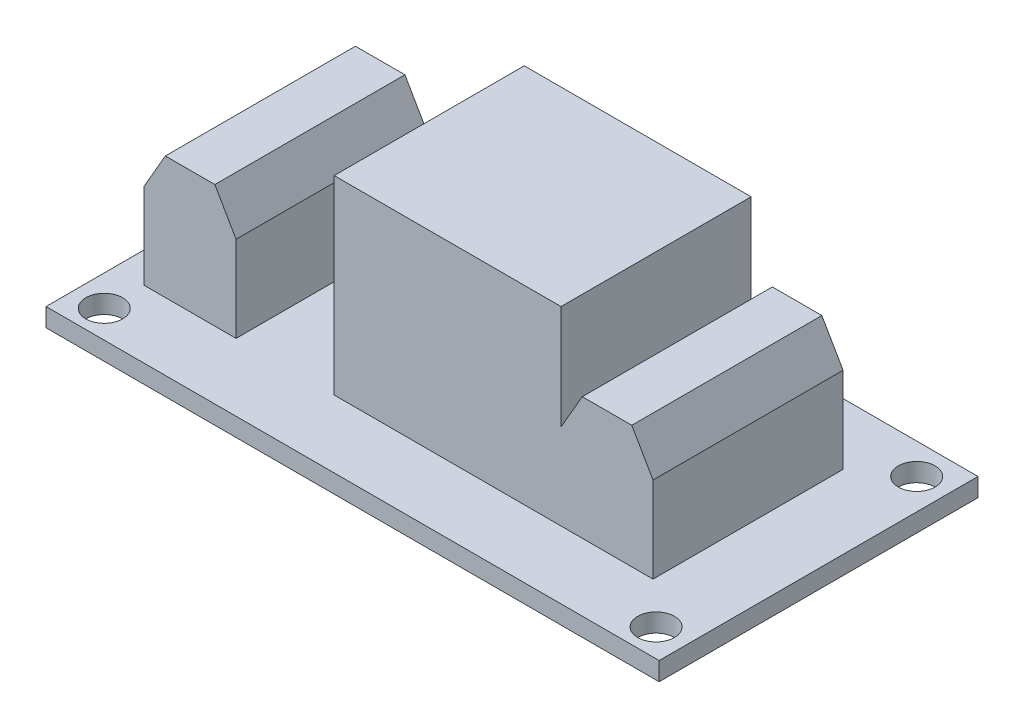
ISO-10303-21;
HEADER;
FILE_DESCRIPTION(('STEP AP214'),'2;1');
FILE_NAME('part.step','',(''),(''),'','','');
FILE_SCHEMA(('AUTOMOTIVE_DESIGN { 1 0 10303 214 1 1 1 1 }'));
ENDSEC;
DATA;
#1=APPLICATION_CONTEXT('core data for automotive mechanical design processes');
#2=APPLICATION_PROTOCOL_DEFINITION('international standard','automotive_design',2000,#1);
#3=PRODUCT_CONTEXT('',#1,'mechanical');
#4=PRODUCT('Part','Part','',(#3));
#5=PRODUCT_RELATED_PRODUCT_CATEGORY('part','',(#4));
#6=PRODUCT_DEFINITION_FORMATION('','',#4);
#7=PRODUCT_DEFINITION_CONTEXT('part definition',#1,'design');
#8=PRODUCT_DEFINITION('design','',#6,#7);
#9=PRODUCT_DEFINITION_SHAPE('','',#8);
#10=(LENGTH_UNIT() NAMED_UNIT(*) SI_UNIT(.MILLI.,.METRE.));
#11=(NAMED_UNIT(*) PLANE_ANGLE_UNIT() SI_UNIT($,.RADIAN.));
#12=(NAMED_UNIT(*) SI_UNIT($,.STERADIAN.) SOLID_ANGLE_UNIT());
#13=UNCERTAINTY_MEASURE_WITH_UNIT(LENGTH_MEASURE(1.E-05),#10,'distance_accuracy_value','');
#14=(GEOMETRIC_REPRESENTATION_CONTEXT(3) GLOBAL_UNCERTAINTY_ASSIGNED_CONTEXT((#13)) GLOBAL_UNIT_ASSIGNED_CONTEXT((#10,
#11,#12)) REPRESENTATION_CONTEXT('',''));
#15=CARTESIAN_POINT('',(0.,0.,0.));
#16=DIRECTION('',(0.,0.,1.));
#17=DIRECTION('',(1.,0.,0.));
#18=AXIS2_PLACEMENT_3D('',#15,#16,#17);
#19=CARTESIAN_POINT('',(0.,1.5,0.));
#20=DIRECTION('',(0.,-1.,0.));
#21=DIRECTION('',(0.,0.,-1.));
#22=AXIS2_PLACEMENT_3D('',#19,#20,#21);
#23=PLANE('',#22);
#24=CARTESIAN_POINT('',(-22.5,1.5,-10.5));
#25=DIRECTION('',(0.,-1.,0.));
#26=DIRECTION('',(0.,0.,-1.));
#27=AXIS2_PLACEMENT_3D('',#24,#25,#26);
#28=CIRCLE('',#27,1.5);
#29=CARTESIAN_POINT('',(-22.5,1.5,-12.));
#30=VERTEX_POINT('',#29);
#31=EDGE_CURVE('E744',#30,#30,#28,.T.);
#32=ORIENTED_EDGE('',*,*,#31,.T.);
#33=EDGE_LOOP('',(#32));
#34=FACE_BOUND('',#33,.T.);
#35=CARTESIAN_POINT('',(22.5,1.5,-10.5));
#36=DIRECTION('',(0.,-1.,0.));
#37=DIRECTION('',(0.,0.,-1.));
#38=AXIS2_PLACEMENT_3D('',#35,#36,#37);
#39=CIRCLE('',#38,1.5);
#40=CARTESIAN_POINT('',(22.5,1.5,-12.));
#41=VERTEX_POINT('',#40);
#42=EDGE_CURVE('E738',#41,#41,#39,.T.);
#43=ORIENTED_EDGE('',*,*,#42,.T.);
#44=EDGE_LOOP('',(#43));
#45=FACE_BOUND('',#44,.T.);
#46=CARTESIAN_POINT('',(22.5,1.5,10.75));
#47=DIRECTION('',(0.,-1.,0.));
#48=DIRECTION('',(0.,0.,-1.));
#49=AXIS2_PLACEMENT_3D('',#46,#47,#48);
#50=CIRCLE('',#49,1.5);
#51=CARTESIAN_POINT('',(22.5,1.5,9.25));
#52=VERTEX_POINT('',#51);
#53=EDGE_CURVE('E735',#52,#52,#50,.T.);
#54=ORIENTED_EDGE('',*,*,#53,.T.);
#55=EDGE_LOOP('',(#54));
#56=FACE_BOUND('',#55,.T.);
#57=CARTESIAN_POINT('',(-22.5,1.5,10.75));
#58=DIRECTION('',(0.,-1.,0.));
#59=DIRECTION('',(0.,0.,-1.));
#60=AXIS2_PLACEMENT_3D('',#57,#58,#59);
#61=CIRCLE('',#60,1.5);
#62=CARTESIAN_POINT('',(-22.5,1.5,9.25));
#63=VERTEX_POINT('',#62);
#64=EDGE_CURVE('E739',#63,#63,#61,.T.);
#65=ORIENTED_EDGE('',*,*,#64,.T.);
#66=EDGE_LOOP('',(#65));
#67=FACE_BOUND('',#66,.T.);
#68=DIRECTION('',(0.,0.,-1.));
#69=VECTOR('',#68,1.);
#70=CARTESIAN_POINT('',(-15.,1.5,7.5));
#71=LINE('',#70,#69);
#72=CARTESIAN_POINT('',(-15.,1.5,7.5));
#73=VERTEX_POINT('',#72);
#74=CARTESIAN_POINT('',(-15.,1.5,-8.));
#75=VERTEX_POINT('',#74);
#76=EDGE_CURVE('E253',#73,#75,#71,.T.);
#77=ORIENTED_EDGE('',*,*,#76,.F.);
#78=DIRECTION('',(1.,0.,0.));
#79=VECTOR('',#78,1.);
#80=CARTESIAN_POINT('',(-22.5,1.5,7.5));
#81=LINE('',#80,#79);
#82=CARTESIAN_POINT('',(-22.5,1.5,7.5));
#83=VERTEX_POINT('',#82);
#84=EDGE_CURVE('E259',#83,#73,#81,.T.);
#85=ORIENTED_EDGE('',*,*,#84,.F.);
#86=DIRECTION('',(0.,0.,1.));
#87=VECTOR('',#86,1.);
#88=CARTESIAN_POINT('',(-22.5,1.5,7.5));
#89=LINE('',#88,#87);
#90=CARTESIAN_POINT('',(-22.5,1.5,-8.));
#91=VERTEX_POINT('',#90);
#92=EDGE_CURVE('E271',#91,#83,#89,.T.);
#93=ORIENTED_EDGE('',*,*,#92,.F.);
#94=DIRECTION('',(-1.,0.,0.));
#95=VECTOR('',#94,1.);
#96=CARTESIAN_POINT('',(-22.5,1.5,-8.));
#97=LINE('',#96,#95);
#98=EDGE_CURVE('E267',#75,#91,#97,.T.);
#99=ORIENTED_EDGE('',*,*,#98,.F.);
#100=EDGE_LOOP('',(#77,#85,#93,#99));
#101=FACE_BOUND('',#100,.T.);
#102=DIRECTION('',(0.,0.,-1.));
#103=VECTOR('',#102,1.);
#104=CARTESIAN_POINT('',(25.,1.5,13.));
#105=LINE('',#104,#103);
#106=CARTESIAN_POINT('',(25.,1.5,13.));
#107=VERTEX_POINT('',#106);
#108=CARTESIAN_POINT('',(25.,1.5,-13.));
#109=VERTEX_POINT('',#108);
#110=EDGE_CURVE('E315',#107,#109,#105,.T.);
#111=ORIENTED_EDGE('',*,*,#110,.T.);
#112=DIRECTION('',(-1.,0.,0.));
#113=VECTOR('',#112,1.);
#114=CARTESIAN_POINT('',(-25.,1.5,-13.));
#115=LINE('',#114,#113);
#116=CARTESIAN_POINT('',(-25.,1.5,-13.));
#117=VERTEX_POINT('',#116);
#118=EDGE_CURVE('E319',#109,#117,#115,.T.);
#119=ORIENTED_EDGE('',*,*,#118,.T.);
#120=DIRECTION('',(0.,0.,1.));
#121=VECTOR('',#120,1.);
#122=CARTESIAN_POINT('',(-25.,1.5,13.));
#123=LINE('',#122,#121);
#124=CARTESIAN_POINT('',(-25.,1.5,13.));
#125=VERTEX_POINT('',#124);
#126=EDGE_CURVE('E323',#117,#125,#123,.T.);
#127=ORIENTED_EDGE('',*,*,#126,.T.);
#128=DIRECTION('',(1.,0.,0.));
#129=VECTOR('',#128,1.);
#130=CARTESIAN_POINT('',(-25.,1.5,13.));
#131=LINE('',#130,#129);
#132=EDGE_CURVE('E326',#125,#107,#131,.T.);
#133=ORIENTED_EDGE('',*,*,#132,.T.);
#134=EDGE_LOOP('',(#111,#119,#127,#133));
#135=FACE_BOUND('',#134,.T.);
#136=DIRECTION('',(0.,0.,1.));
#137=VECTOR('',#136,1.);
#138=CARTESIAN_POINT('',(-7.,1.5,7.5));
#139=LINE('',#138,#137);
#140=CARTESIAN_POINT('',(-7.,1.5,-8.));
#141=VERTEX_POINT('',#140);
#142=CARTESIAN_POINT('',(-7.,1.5,7.5));
#143=VERTEX_POINT('',#142);
#144=EDGE_CURVE('E214',#141,#143,#139,.T.);
#145=ORIENTED_EDGE('',*,*,#144,.F.);
#146=DIRECTION('',(-1.,0.,0.));
#147=VECTOR('',#146,1.);
#148=CARTESIAN_POINT('',(11.5,1.5,-8.));
#149=LINE('',#148,#147);
#150=CARTESIAN_POINT('',(19.,1.5,-8.));
#151=VERTEX_POINT('',#150);
#152=EDGE_CURVE('E303',#151,#141,#149,.T.);
#153=ORIENTED_EDGE('',*,*,#152,.F.);
#154=DIRECTION('',(0.,0.,-1.));
#155=VECTOR('',#154,1.);
#156=CARTESIAN_POINT('',(19.,1.5,-8.));
#157=LINE('',#156,#155);
#158=CARTESIAN_POINT('',(19.,1.5,7.5));
#159=VERTEX_POINT('',#158);
#160=EDGE_CURVE('E289',#159,#151,#157,.T.);
#161=ORIENTED_EDGE('',*,*,#160,.F.);
#162=DIRECTION('',(1.,0.,0.));
#163=VECTOR('',#162,1.);
#164=CARTESIAN_POINT('',(11.5,1.5,7.5));
#165=LINE('',#164,#163);
#166=EDGE_CURVE('E295',#143,#159,#165,.T.);
#167=ORIENTED_EDGE('',*,*,#166,.F.);
#168=EDGE_LOOP('',(#145,#153,#161,#167));
#169=FACE_BOUND('',#168,.T.);
#170=ADVANCED_FACE('F41',(#34,#45,#56,#67,#101,#135,#169),#23,.F.);
#171=CARTESIAN_POINT('',(25.,1.5,13.));
#172=DIRECTION('',(-1.,0.,0.));
#173=DIRECTION('',(0.,0.,1.));
#174=AXIS2_PLACEMENT_3D('',#171,#172,#173);
#175=PLANE('',#174);
#176=DIRECTION('',(0.,0.,-1.));
#177=VECTOR('',#176,1.);
#178=CARTESIAN_POINT('',(25.,0.,13.));
#179=LINE('',#178,#177);
#180=CARTESIAN_POINT('',(25.,0.,13.));
#181=VERTEX_POINT('',#180);
#182=CARTESIAN_POINT('',(25.,0.,-13.));
#183=VERTEX_POINT('',#182);
#184=EDGE_CURVE('E314',#181,#183,#179,.T.);
#185=ORIENTED_EDGE('',*,*,#184,.T.);
#186=DIRECTION('',(0.,-1.,0.));
#187=VECTOR('',#186,1.);
#188=CARTESIAN_POINT('',(25.,1.5,-13.));
#189=LINE('',#188,#187);
#190=EDGE_CURVE('E352',#109,#183,#189,.T.);
#191=ORIENTED_EDGE('',*,*,#190,.F.);
#192=ORIENTED_EDGE('',*,*,#110,.F.);
#193=DIRECTION('',(0.,-1.,0.));
#194=VECTOR('',#193,1.);
#195=CARTESIAN_POINT('',(25.,1.5,13.));
#196=LINE('',#195,#194);
#197=EDGE_CURVE('E329',#107,#181,#196,.T.);
#198=ORIENTED_EDGE('',*,*,#197,.T.);
#199=EDGE_LOOP('',(#185,#191,#192,#198));
#200=FACE_BOUND('',#199,.T.);
#201=ADVANCED_FACE('F445',(#200),#175,.F.);
#202=CARTESIAN_POINT('',(-25.,1.5,-13.));
#203=DIRECTION('',(0.,0.,1.));
#204=DIRECTION('',(1.,0.,0.));
#205=AXIS2_PLACEMENT_3D('',#202,#203,#204);
#206=PLANE('',#205);
#207=DIRECTION('',(-1.,0.,0.));
#208=VECTOR('',#207,1.);
#209=CARTESIAN_POINT('',(-25.,0.,-13.));
#210=LINE('',#209,#208);
#211=CARTESIAN_POINT('',(-25.,0.,-13.));
#212=VERTEX_POINT('',#211);
#213=EDGE_CURVE('E333',#183,#212,#210,.T.);
#214=ORIENTED_EDGE('',*,*,#213,.T.);
#215=DIRECTION('',(0.,-1.,0.));
#216=VECTOR('',#215,1.);
#217=CARTESIAN_POINT('',(-25.,1.5,-13.));
#218=LINE('',#217,#216);
#219=EDGE_CURVE('E348',#117,#212,#218,.T.);
#220=ORIENTED_EDGE('',*,*,#219,.F.);
#221=ORIENTED_EDGE('',*,*,#118,.F.);
#222=ORIENTED_EDGE('',*,*,#190,.T.);
#223=EDGE_LOOP('',(#214,#220,#221,#222));
#224=FACE_BOUND('',#223,.T.);
#225=ADVANCED_FACE('F451',(#224),#206,.F.);
#226=CARTESIAN_POINT('',(-25.,1.5,13.));
#227=DIRECTION('',(1.,0.,0.));
#228=DIRECTION('',(0.,0.,-1.));
#229=AXIS2_PLACEMENT_3D('',#226,#227,#228);
#230=PLANE('',#229);
#231=DIRECTION('',(0.,0.,1.));
#232=VECTOR('',#231,1.);
#233=CARTESIAN_POINT('',(-25.,0.,13.));
#234=LINE('',#233,#232);
#235=CARTESIAN_POINT('',(-25.,0.,13.));
#236=VERTEX_POINT('',#235);
#237=EDGE_CURVE('E336',#212,#236,#234,.T.);
#238=ORIENTED_EDGE('',*,*,#237,.T.);
#239=DIRECTION('',(0.,-1.,0.));
#240=VECTOR('',#239,1.);
#241=CARTESIAN_POINT('',(-25.,1.5,13.));
#242=LINE('',#241,#240);
#243=EDGE_CURVE('E344',#125,#236,#242,.T.);
#244=ORIENTED_EDGE('',*,*,#243,.F.);
#245=ORIENTED_EDGE('',*,*,#126,.F.);
#246=ORIENTED_EDGE('',*,*,#219,.T.);
#247=EDGE_LOOP('',(#238,#244,#245,#246));
#248=FACE_BOUND('',#247,.T.);
#249=ADVANCED_FACE('F467',(#248),#230,.F.);
#250=CARTESIAN_POINT('',(-25.,1.5,13.));
#251=DIRECTION('',(0.,0.,-1.));
#252=DIRECTION('',(-1.,0.,0.));
#253=AXIS2_PLACEMENT_3D('',#250,#251,#252);
#254=PLANE('',#253);
#255=DIRECTION('',(1.,0.,0.));
#256=VECTOR('',#255,1.);
#257=CARTESIAN_POINT('',(-25.,0.,13.));
#258=LINE('',#257,#256);
#259=EDGE_CURVE('E320',#236,#181,#258,.T.);
#260=ORIENTED_EDGE('',*,*,#259,.T.);
#261=ORIENTED_EDGE('',*,*,#197,.F.);
#262=ORIENTED_EDGE('',*,*,#132,.F.);
#263=ORIENTED_EDGE('',*,*,#243,.T.);
#264=EDGE_LOOP('',(#260,#261,#262,#263));
#265=FACE_BOUND('',#264,.T.);
#266=ADVANCED_FACE('F463',(#265),#254,.F.);
#267=CARTESIAN_POINT('',(0.,0.,0.));
#268=DIRECTION('',(0.,-1.,0.));
#269=DIRECTION('',(0.,0.,-1.));
#270=AXIS2_PLACEMENT_3D('',#267,#268,#269);
#271=PLANE('',#270);
#272=CARTESIAN_POINT('',(-22.5,0.,-10.5));
#273=DIRECTION('',(0.,-1.,0.));
#274=DIRECTION('',(0.,0.,-1.));
#275=AXIS2_PLACEMENT_3D('',#272,#273,#274);
#276=CIRCLE('',#275,1.5);
#277=CARTESIAN_POINT('',(-22.5,0.,-12.));
#278=VERTEX_POINT('',#277);
#279=EDGE_CURVE('E788',#278,#278,#276,.T.);
#280=ORIENTED_EDGE('',*,*,#279,.F.);
#281=EDGE_LOOP('',(#280));
#282=FACE_BOUND('',#281,.T.);
#283=CARTESIAN_POINT('',(22.5,0.,-10.5));
#284=DIRECTION('',(0.,-1.,0.));
#285=DIRECTION('',(0.,0.,-1.));
#286=AXIS2_PLACEMENT_3D('',#283,#284,#285);
#287=CIRCLE('',#286,1.5);
#288=CARTESIAN_POINT('',(22.5,0.,-12.));
#289=VERTEX_POINT('',#288);
#290=EDGE_CURVE('E792',#289,#289,#287,.T.);
#291=ORIENTED_EDGE('',*,*,#290,.F.);
#292=EDGE_LOOP('',(#291));
#293=FACE_BOUND('',#292,.T.);
#294=CARTESIAN_POINT('',(22.5,0.,10.75));
#295=DIRECTION('',(0.,-1.,0.));
#296=DIRECTION('',(0.,0.,-1.));
#297=AXIS2_PLACEMENT_3D('',#294,#295,#296);
#298=CIRCLE('',#297,1.5);
#299=CARTESIAN_POINT('',(22.5,0.,9.25));
#300=VERTEX_POINT('',#299);
#301=EDGE_CURVE('E732',#300,#300,#298,.T.);
#302=ORIENTED_EDGE('',*,*,#301,.F.);
#303=EDGE_LOOP('',(#302));
#304=FACE_BOUND('',#303,.T.);
#305=CARTESIAN_POINT('',(-22.5,0.,10.75));
#306=DIRECTION('',(0.,-1.,0.));
#307=DIRECTION('',(0.,0.,-1.));
#308=AXIS2_PLACEMENT_3D('',#305,#306,#307);
#309=CIRCLE('',#308,1.5);
#310=CARTESIAN_POINT('',(-22.5,0.,9.25));
#311=VERTEX_POINT('',#310);
#312=EDGE_CURVE('E747',#311,#311,#309,.T.);
#313=ORIENTED_EDGE('',*,*,#312,.F.);
#314=EDGE_LOOP('',(#313));
#315=FACE_BOUND('',#314,.T.);
#316=DIRECTION('',(0.,0.,1.));
#317=VECTOR('',#316,1.);
#318=CARTESIAN_POINT('',(15.,0.,-7.5));
#319=LINE('',#318,#317);
#320=CARTESIAN_POINT('',(15.,0.,-7.5));
#321=VERTEX_POINT('',#320);
#322=CARTESIAN_POINT('',(15.,0.,7.5));
#323=VERTEX_POINT('',#322);
#324=EDGE_CURVE('E58',#321,#323,#319,.T.);
#325=ORIENTED_EDGE('',*,*,#324,.F.);
#326=DIRECTION('',(1.,0.,0.));
#327=VECTOR('',#326,1.);
#328=CARTESIAN_POINT('',(-15.,0.,-7.5));
#329=LINE('',#328,#327);
#330=CARTESIAN_POINT('',(-15.,0.,-7.5));
#331=VERTEX_POINT('',#330);
#332=EDGE_CURVE('E62',#331,#321,#329,.T.);
#333=ORIENTED_EDGE('',*,*,#332,.F.);
#334=DIRECTION('',(0.,0.,-1.));
#335=VECTOR('',#334,1.);
#336=CARTESIAN_POINT('',(-15.,0.,-7.5));
#337=LINE('',#336,#335);
#338=CARTESIAN_POINT('',(-15.,0.,7.5));
#339=VERTEX_POINT('',#338);
#340=EDGE_CURVE('E763',#339,#331,#337,.T.);
#341=ORIENTED_EDGE('',*,*,#340,.F.);
#342=DIRECTION('',(-1.,0.,0.));
#343=VECTOR('',#342,1.);
#344=CARTESIAN_POINT('',(-15.,0.,7.5));
#345=LINE('',#344,#343);
#346=EDGE_CURVE('E760',#323,#339,#345,.T.);
#347=ORIENTED_EDGE('',*,*,#346,.F.);
#348=EDGE_LOOP('',(#325,#333,#341,#347));
#349=FACE_BOUND('',#348,.T.);
#350=ORIENTED_EDGE('',*,*,#184,.F.);
#351=ORIENTED_EDGE('',*,*,#259,.F.);
#352=ORIENTED_EDGE('',*,*,#237,.F.);
#353=ORIENTED_EDGE('',*,*,#213,.F.);
#354=EDGE_LOOP('',(#350,#351,#352,#353));
#355=FACE_BOUND('',#354,.T.);
#356=ADVANCED_FACE('F460',(#282,#293,#304,#315,#349,#355),#271,.T.);
#357=CARTESIAN_POINT('',(19.,11.5,-8.));
#358=DIRECTION('',(-1.,0.,0.));
#359=DIRECTION('',(0.,0.,1.));
#360=AXIS2_PLACEMENT_3D('',#357,#358,#359);
#361=PLANE('',#360);
#362=DIRECTION('',(0.,-1.,0.));
#363=VECTOR('',#362,1.);
#364=CARTESIAN_POINT('',(19.,11.5,-8.));
#365=LINE('',#364,#363);
#366=CARTESIAN_POINT('',(19.,8.49999999999998,-8.));
#367=VERTEX_POINT('',#366);
#368=EDGE_CURVE('E311',#367,#151,#365,.T.);
#369=ORIENTED_EDGE('',*,*,#368,.F.);
#370=DIRECTION('',(0.,0.,1.));
#371=VECTOR('',#370,1.);
#372=CARTESIAN_POINT('',(19.,8.49999999999998,7.5));
#373=LINE('',#372,#371);
#374=CARTESIAN_POINT('',(19.,8.49999999999998,7.5));
#375=VERTEX_POINT('',#374);
#376=EDGE_CURVE('E370',#367,#375,#373,.T.);
#377=ORIENTED_EDGE('',*,*,#376,.T.);
#378=DIRECTION('',(0.,-1.,0.));
#379=VECTOR('',#378,1.);
#380=CARTESIAN_POINT('',(19.,11.5,7.5));
#381=LINE('',#380,#379);
#382=EDGE_CURVE('E299',#375,#159,#381,.T.);
#383=ORIENTED_EDGE('',*,*,#382,.T.);
#384=ORIENTED_EDGE('',*,*,#160,.T.);
#385=EDGE_LOOP('',(#369,#377,#383,#384));
#386=FACE_BOUND('',#385,.T.);
#387=ADVANCED_FACE('F458',(#386),#361,.F.);
#388=CARTESIAN_POINT('',(11.5,11.5,-8.));
#389=DIRECTION('',(0.,0.,1.));
#390=DIRECTION('',(1.,0.,0.));
#391=AXIS2_PLACEMENT_3D('',#388,#389,#390);
#392=PLANE('',#391);
#393=DIRECTION('',(-1.,0.,0.));
#394=VECTOR('',#393,1.);
#395=CARTESIAN_POINT('',(11.5,11.5,-8.));
#396=LINE('',#395,#394);
#397=CARTESIAN_POINT('',(17.2679491924311,11.5,-8.));
#398=VERTEX_POINT('',#397);
#399=CARTESIAN_POINT('',(13.2320508075689,11.5,-8.));
#400=VERTEX_POINT('',#399);
#401=EDGE_CURVE('E290',#398,#400,#396,.T.);
#402=ORIENTED_EDGE('',*,*,#401,.F.);
#403=DIRECTION('',(0.499999999999998,-0.86602540378444,0.));
#404=VECTOR('',#403,1.);
#405=CARTESIAN_POINT('',(17.2679491924311,11.5,-8.));
#406=LINE('',#405,#404);
#407=EDGE_CURVE('E367',#398,#367,#406,.T.);
#408=ORIENTED_EDGE('',*,*,#407,.T.);
#409=ORIENTED_EDGE('',*,*,#368,.T.);
#410=ORIENTED_EDGE('',*,*,#152,.T.);
#411=DIRECTION('',(0.,-1.,0.));
#412=VECTOR('',#411,1.);
#413=CARTESIAN_POINT('',(-7.,17.,-8.));
#414=LINE('',#413,#412);
#415=CARTESIAN_POINT('',(-7.,17.,-8.));
#416=VERTEX_POINT('',#415);
#417=EDGE_CURVE('E245',#416,#141,#414,.T.);
#418=ORIENTED_EDGE('',*,*,#417,.F.);
#419=DIRECTION('',(-1.,0.,0.));
#420=VECTOR('',#419,1.);
#421=CARTESIAN_POINT('',(-7.,17.,-8.));
#422=LINE('',#421,#420);
#423=CARTESIAN_POINT('',(11.5,17.,-8.));
#424=VERTEX_POINT('',#423);
#425=EDGE_CURVE('E228',#424,#416,#422,.T.);
#426=ORIENTED_EDGE('',*,*,#425,.F.);
#427=DIRECTION('',(0.,-1.,0.));
#428=VECTOR('',#427,1.);
#429=CARTESIAN_POINT('',(11.5,17.,-8.));
#430=LINE('',#429,#428);
#431=CARTESIAN_POINT('',(11.5,8.49999999999998,-8.));
#432=VERTEX_POINT('',#431);
#433=EDGE_CURVE('E249',#424,#432,#430,.T.);
#434=ORIENTED_EDGE('',*,*,#433,.T.);
#435=DIRECTION('',(0.499999999999998,0.86602540378444,0.));
#436=VECTOR('',#435,1.);
#437=CARTESIAN_POINT('',(13.2320508075689,11.5,-8.));
#438=LINE('',#437,#436);
#439=EDGE_CURVE('E364',#432,#400,#438,.T.);
#440=ORIENTED_EDGE('',*,*,#439,.T.);
#441=EDGE_LOOP('',(#402,#408,#409,#410,#418,#426,#434,#440));
#442=FACE_BOUND('',#441,.T.);
#443=ADVANCED_FACE('F501',(#442),#392,.F.);
#444=CARTESIAN_POINT('',(11.5,11.5,7.5));
#445=DIRECTION('',(0.,0.,-1.));
#446=DIRECTION('',(-1.,0.,0.));
#447=AXIS2_PLACEMENT_3D('',#444,#445,#446);
#448=PLANE('',#447);
#449=ORIENTED_EDGE('',*,*,#382,.F.);
#450=DIRECTION('',(-0.499999999999998,0.86602540378444,0.));
#451=VECTOR('',#450,1.);
#452=CARTESIAN_POINT('',(17.2679491924311,11.5,7.5));
#453=LINE('',#452,#451);
#454=CARTESIAN_POINT('',(17.2679491924311,11.5,7.5));
#455=VERTEX_POINT('',#454);
#456=EDGE_CURVE('E376',#375,#455,#453,.T.);
#457=ORIENTED_EDGE('',*,*,#456,.T.);
#458=DIRECTION('',(1.,0.,0.));
#459=VECTOR('',#458,1.);
#460=CARTESIAN_POINT('',(11.5,11.5,7.5));
#461=LINE('',#460,#459);
#462=CARTESIAN_POINT('',(13.2320508075689,11.5,7.5));
#463=VERTEX_POINT('',#462);
#464=EDGE_CURVE('E294',#463,#455,#461,.T.);
#465=ORIENTED_EDGE('',*,*,#464,.F.);
#466=DIRECTION('',(-0.499999999999998,-0.86602540378444,0.));
#467=VECTOR('',#466,1.);
#468=CARTESIAN_POINT('',(13.2320508075689,11.5,7.5));
#469=LINE('',#468,#467);
#470=CARTESIAN_POINT('',(11.5,8.49999999999998,7.5));
#471=VERTEX_POINT('',#470);
#472=EDGE_CURVE('E373',#463,#471,#469,.T.);
#473=ORIENTED_EDGE('',*,*,#472,.T.);
#474=DIRECTION('',(0.,-1.,0.));
#475=VECTOR('',#474,1.);
#476=CARTESIAN_POINT('',(11.5,17.,7.5));
#477=LINE('',#476,#475);
#478=CARTESIAN_POINT('',(11.5,17.,7.5));
#479=VERTEX_POINT('',#478);
#480=EDGE_CURVE('E236',#479,#471,#477,.T.);
#481=ORIENTED_EDGE('',*,*,#480,.F.);
#482=DIRECTION('',(1.,0.,0.));
#483=VECTOR('',#482,1.);
#484=CARTESIAN_POINT('',(-7.,17.,7.5));
#485=LINE('',#484,#483);
#486=CARTESIAN_POINT('',(-7.,17.,7.5));
#487=VERTEX_POINT('',#486);
#488=EDGE_CURVE('E234',#487,#479,#485,.T.);
#489=ORIENTED_EDGE('',*,*,#488,.F.);
#490=DIRECTION('',(0.,-1.,0.));
#491=VECTOR('',#490,1.);
#492=CARTESIAN_POINT('',(-7.,17.,7.5));
#493=LINE('',#492,#491);
#494=EDGE_CURVE('E241',#487,#143,#493,.T.);
#495=ORIENTED_EDGE('',*,*,#494,.T.);
#496=ORIENTED_EDGE('',*,*,#166,.T.);
#497=EDGE_LOOP('',(#449,#457,#465,#473,#481,#489,#495,#496));
#498=FACE_BOUND('',#497,.T.);
#499=ADVANCED_FACE('F510',(#498),#448,.F.);
#500=CARTESIAN_POINT('',(0.,11.5,0.));
#501=DIRECTION('',(0.,1.,0.));
#502=DIRECTION('',(0.,0.,1.));
#503=AXIS2_PLACEMENT_3D('',#500,#501,#502);
#504=PLANE('',#503);
#505=ORIENTED_EDGE('',*,*,#464,.T.);
#506=DIRECTION('',(0.,0.,-1.));
#507=VECTOR('',#506,1.);
#508=CARTESIAN_POINT('',(17.2679491924311,11.5,-8.));
#509=LINE('',#508,#507);
#510=EDGE_CURVE('E360',#455,#398,#509,.T.);
#511=ORIENTED_EDGE('',*,*,#510,.T.);
#512=ORIENTED_EDGE('',*,*,#401,.T.);
#513=DIRECTION('',(0.,0.,1.));
#514=VECTOR('',#513,1.);
#515=CARTESIAN_POINT('',(13.2320508075689,11.5,7.5));
#516=LINE('',#515,#514);
#517=EDGE_CURVE('E356',#400,#463,#516,.T.);
#518=ORIENTED_EDGE('',*,*,#517,.T.);
#519=EDGE_LOOP('',(#505,#511,#512,#518));
#520=FACE_BOUND('',#519,.T.);
#521=ADVANCED_FACE('F513',(#520),#504,.T.);
#522=CARTESIAN_POINT('',(-15.,11.5,7.5));
#523=DIRECTION('',(-1.,0.,0.));
#524=DIRECTION('',(0.,0.,1.));
#525=AXIS2_PLACEMENT_3D('',#522,#523,#524);
#526=PLANE('',#525);
#527=DIRECTION('',(0.,-1.,0.));
#528=VECTOR('',#527,1.);
#529=CARTESIAN_POINT('',(-15.,11.5,-8.));
#530=LINE('',#529,#528);
#531=CARTESIAN_POINT('',(-15.,8.49999999999998,-8.));
#532=VERTEX_POINT('',#531);
#533=EDGE_CURVE('E286',#532,#75,#530,.T.);
#534=ORIENTED_EDGE('',*,*,#533,.F.);
#535=DIRECTION('',(0.,0.,1.));
#536=VECTOR('',#535,1.);
#537=CARTESIAN_POINT('',(-15.,8.49999999999998,7.5));
#538=LINE('',#537,#536);
#539=CARTESIAN_POINT('',(-15.,8.49999999999998,7.5));
#540=VERTEX_POINT('',#539);
#541=EDGE_CURVE('E397',#532,#540,#538,.T.);
#542=ORIENTED_EDGE('',*,*,#541,.T.);
#543=DIRECTION('',(0.,-1.,0.));
#544=VECTOR('',#543,1.);
#545=CARTESIAN_POINT('',(-15.,11.5,7.5));
#546=LINE('',#545,#544);
#547=EDGE_CURVE('E263',#540,#73,#546,.T.);
#548=ORIENTED_EDGE('',*,*,#547,.T.);
#549=ORIENTED_EDGE('',*,*,#76,.T.);
#550=EDGE_LOOP('',(#534,#542,#548,#549));
#551=FACE_BOUND('',#550,.T.);
#552=ADVANCED_FACE('F421',(#551),#526,.F.);
#553=CARTESIAN_POINT('',(-22.5,11.5,-8.));
#554=DIRECTION('',(0.,0.,1.));
#555=DIRECTION('',(1.,0.,0.));
#556=AXIS2_PLACEMENT_3D('',#553,#554,#555);
#557=PLANE('',#556);
#558=DIRECTION('',(-1.,0.,0.));
#559=VECTOR('',#558,1.);
#560=CARTESIAN_POINT('',(-22.5,11.5,-8.));
#561=LINE('',#560,#559);
#562=CARTESIAN_POINT('',(-16.7320508075689,11.5,-8.));
#563=VERTEX_POINT('',#562);
#564=CARTESIAN_POINT('',(-20.7679491924311,11.5,-8.));
#565=VERTEX_POINT('',#564);
#566=EDGE_CURVE('E254',#563,#565,#561,.T.);
#567=ORIENTED_EDGE('',*,*,#566,.F.);
#568=DIRECTION('',(-0.499999999999998,0.86602540378444,0.));
#569=VECTOR('',#568,1.);
#570=CARTESIAN_POINT('',(-16.7320508075689,11.5,-8.));
#571=LINE('',#570,#569);
#572=EDGE_CURVE('E394',#563,#532,#571,.F.);
#573=ORIENTED_EDGE('',*,*,#572,.T.);
#574=ORIENTED_EDGE('',*,*,#533,.T.);
#575=ORIENTED_EDGE('',*,*,#98,.T.);
#576=DIRECTION('',(0.,-1.,0.));
#577=VECTOR('',#576,1.);
#578=CARTESIAN_POINT('',(-22.5,11.5,-8.));
#579=LINE('',#578,#577);
#580=CARTESIAN_POINT('',(-22.5,8.49999999999998,-8.));
#581=VERTEX_POINT('',#580);
#582=EDGE_CURVE('E283',#581,#91,#579,.T.);
#583=ORIENTED_EDGE('',*,*,#582,.F.);
#584=DIRECTION('',(-0.499999999999998,-0.86602540378444,0.));
#585=VECTOR('',#584,1.);
#586=CARTESIAN_POINT('',(-20.7679491924311,11.5,-8.));
#587=LINE('',#586,#585);
#588=EDGE_CURVE('E391',#581,#565,#587,.F.);
#589=ORIENTED_EDGE('',*,*,#588,.T.);
#590=EDGE_LOOP('',(#567,#573,#574,#575,#583,#589));
#591=FACE_BOUND('',#590,.T.);
#592=ADVANCED_FACE('F418',(#591),#557,.F.);
#593=CARTESIAN_POINT('',(-22.5,11.5,7.5));
#594=DIRECTION('',(1.,0.,0.));
#595=DIRECTION('',(0.,0.,-1.));
#596=AXIS2_PLACEMENT_3D('',#593,#594,#595);
#597=PLANE('',#596);
#598=DIRECTION('',(0.,-1.,0.));
#599=VECTOR('',#598,1.);
#600=CARTESIAN_POINT('',(-22.5,11.5,7.5));
#601=LINE('',#600,#599);
#602=CARTESIAN_POINT('',(-22.5,8.49999999999998,7.5));
#603=VERTEX_POINT('',#602);
#604=EDGE_CURVE('E280',#603,#83,#601,.T.);
#605=ORIENTED_EDGE('',*,*,#604,.F.);
#606=DIRECTION('',(0.,0.,-1.));
#607=VECTOR('',#606,1.);
#608=CARTESIAN_POINT('',(-22.5,8.49999999999998,7.5));
#609=LINE('',#608,#607);
#610=EDGE_CURVE('E11',#603,#581,#609,.T.);
#611=ORIENTED_EDGE('',*,*,#610,.T.);
#612=ORIENTED_EDGE('',*,*,#582,.T.);
#613=ORIENTED_EDGE('',*,*,#92,.T.);
#614=EDGE_LOOP('',(#605,#611,#612,#613));
#615=FACE_BOUND('',#614,.T.);
#616=ADVANCED_FACE('F430',(#615),#597,.F.);
#617=CARTESIAN_POINT('',(-22.5,11.5,7.5));
#618=DIRECTION('',(0.,0.,-1.));
#619=DIRECTION('',(-1.,0.,0.));
#620=AXIS2_PLACEMENT_3D('',#617,#618,#619);
#621=PLANE('',#620);
#622=ORIENTED_EDGE('',*,*,#547,.F.);
#623=DIRECTION('',(0.499999999999998,-0.86602540378444,0.));
#624=VECTOR('',#623,1.);
#625=CARTESIAN_POINT('',(-16.7320508075689,11.5,7.5));
#626=LINE('',#625,#624);
#627=CARTESIAN_POINT('',(-16.7320508075689,11.5,7.5));
#628=VERTEX_POINT('',#627);
#629=EDGE_CURVE('E51',#540,#628,#626,.F.);
#630=ORIENTED_EDGE('',*,*,#629,.T.);
#631=DIRECTION('',(1.,0.,0.));
#632=VECTOR('',#631,1.);
#633=CARTESIAN_POINT('',(-22.5,11.5,7.5));
#634=LINE('',#633,#632);
#635=CARTESIAN_POINT('',(-20.7679491924311,11.5,7.5));
#636=VERTEX_POINT('',#635);
#637=EDGE_CURVE('E258',#636,#628,#634,.T.);
#638=ORIENTED_EDGE('',*,*,#637,.F.);
#639=DIRECTION('',(0.499999999999998,0.86602540378444,0.));
#640=VECTOR('',#639,1.);
#641=CARTESIAN_POINT('',(-20.7679491924311,11.5,7.5));
#642=LINE('',#641,#640);
#643=EDGE_CURVE('E400',#636,#603,#642,.F.);
#644=ORIENTED_EDGE('',*,*,#643,.T.);
#645=ORIENTED_EDGE('',*,*,#604,.T.);
#646=ORIENTED_EDGE('',*,*,#84,.T.);
#647=EDGE_LOOP('',(#622,#630,#638,#644,#645,#646));
#648=FACE_BOUND('',#647,.T.);
#649=ADVANCED_FACE('F407',(#648),#621,.F.);
#650=CARTESIAN_POINT('',(0.,11.5,0.));
#651=DIRECTION('',(0.,-1.,0.));
#652=DIRECTION('',(0.,0.,-1.));
#653=AXIS2_PLACEMENT_3D('',#650,#651,#652);
#654=PLANE('',#653);
#655=ORIENTED_EDGE('',*,*,#637,.T.);
#656=DIRECTION('',(0.,0.,-1.));
#657=VECTOR('',#656,1.);
#658=CARTESIAN_POINT('',(-16.7320508075689,11.5,0.));
#659=LINE('',#658,#657);
#660=EDGE_CURVE('E387',#628,#563,#659,.T.);
#661=ORIENTED_EDGE('',*,*,#660,.T.);
#662=ORIENTED_EDGE('',*,*,#566,.T.);
#663=DIRECTION('',(0.,0.,1.));
#664=VECTOR('',#663,1.);
#665=CARTESIAN_POINT('',(-20.7679491924311,11.5,0.));
#666=LINE('',#665,#664);
#667=EDGE_CURVE('E383',#565,#636,#666,.T.);
#668=ORIENTED_EDGE('',*,*,#667,.T.);
#669=EDGE_LOOP('',(#655,#661,#662,#668));
#670=FACE_BOUND('',#669,.T.);
#671=ADVANCED_FACE('F412',(#670),#654,.F.);
#672=CARTESIAN_POINT('',(17.2679491924311,11.5,0.));
#673=DIRECTION('',(0.86602540378444,0.499999999999998,0.));
#674=DIRECTION('',(0.,0.,1.));
#675=AXIS2_PLACEMENT_3D('',#672,#673,#674);
#676=PLANE('',#675);
#677=ORIENTED_EDGE('',*,*,#456,.F.);
#678=ORIENTED_EDGE('',*,*,#376,.F.);
#679=ORIENTED_EDGE('',*,*,#407,.F.);
#680=ORIENTED_EDGE('',*,*,#510,.F.);
#681=EDGE_LOOP('',(#677,#678,#679,#680));
#682=FACE_BOUND('',#681,.T.);
#683=ADVANCED_FACE('F476',(#682),#676,.T.);
#684=CARTESIAN_POINT('',(13.2320508075689,11.5,0.));
#685=DIRECTION('',(-0.86602540378444,0.499999999999998,0.));
#686=DIRECTION('',(0.,0.,-1.));
#687=AXIS2_PLACEMENT_3D('',#684,#685,#686);
#688=PLANE('',#687);
#689=ORIENTED_EDGE('',*,*,#439,.F.);
#690=DIRECTION('',(0.,0.,-1.));
#691=VECTOR('',#690,1.);
#692=CARTESIAN_POINT('',(11.5,8.49999999999998,-8.));
#693=LINE('',#692,#691);
#694=EDGE_CURVE('E379',#471,#432,#693,.T.);
#695=ORIENTED_EDGE('',*,*,#694,.F.);
#696=ORIENTED_EDGE('',*,*,#472,.F.);
#697=ORIENTED_EDGE('',*,*,#517,.F.);
#698=EDGE_LOOP('',(#689,#695,#696,#697));
#699=FACE_BOUND('',#698,.T.);
#700=ADVANCED_FACE('F443',(#699),#688,.T.);
#701=CARTESIAN_POINT('',(-16.7320508075689,11.5,0.));
#702=DIRECTION('',(-0.86602540378444,-0.499999999999998,0.));
#703=DIRECTION('',(0.,0.,-1.));
#704=AXIS2_PLACEMENT_3D('',#701,#702,#703);
#705=PLANE('',#704);
#706=ORIENTED_EDGE('',*,*,#629,.F.);
#707=ORIENTED_EDGE('',*,*,#541,.F.);
#708=ORIENTED_EDGE('',*,*,#572,.F.);
#709=ORIENTED_EDGE('',*,*,#660,.F.);
#710=EDGE_LOOP('',(#706,#707,#708,#709));
#711=FACE_BOUND('',#710,.T.);
#712=ADVANCED_FACE('F415',(#711),#705,.F.);
#713=CARTESIAN_POINT('',(-20.7679491924311,11.5,0.));
#714=DIRECTION('',(0.86602540378444,-0.499999999999998,0.));
#715=DIRECTION('',(0.,0.,1.));
#716=AXIS2_PLACEMENT_3D('',#713,#714,#715);
#717=PLANE('',#716);
#718=ORIENTED_EDGE('',*,*,#588,.F.);
#719=ORIENTED_EDGE('',*,*,#610,.F.);
#720=ORIENTED_EDGE('',*,*,#643,.F.);
#721=ORIENTED_EDGE('',*,*,#667,.F.);
#722=EDGE_LOOP('',(#718,#719,#720,#721));
#723=FACE_BOUND('',#722,.T.);
#724=ADVANCED_FACE('F44',(#723),#717,.F.);
#725=CARTESIAN_POINT('',(11.5,17.,7.5));
#726=DIRECTION('',(-1.,0.,0.));
#727=DIRECTION('',(0.,0.,1.));
#728=AXIS2_PLACEMENT_3D('',#725,#726,#727);
#729=PLANE('',#728);
#730=ORIENTED_EDGE('',*,*,#694,.T.);
#731=ORIENTED_EDGE('',*,*,#433,.F.);
#732=DIRECTION('',(0.,0.,-1.));
#733=VECTOR('',#732,1.);
#734=CARTESIAN_POINT('',(11.5,17.,7.5));
#735=LINE('',#734,#733);
#736=EDGE_CURVE('E219',#479,#424,#735,.T.);
#737=ORIENTED_EDGE('',*,*,#736,.F.);
#738=ORIENTED_EDGE('',*,*,#480,.T.);
#739=EDGE_LOOP('',(#730,#731,#737,#738));
#740=FACE_BOUND('',#739,.T.);
#741=ADVANCED_FACE('F435',(#740),#729,.F.);
#742=CARTESIAN_POINT('',(-7.,17.,7.5));
#743=DIRECTION('',(1.,0.,0.));
#744=DIRECTION('',(0.,0.,-1.));
#745=AXIS2_PLACEMENT_3D('',#742,#743,#744);
#746=PLANE('',#745);
#747=ORIENTED_EDGE('',*,*,#144,.T.);
#748=ORIENTED_EDGE('',*,*,#494,.F.);
#749=DIRECTION('',(0.,0.,1.));
#750=VECTOR('',#749,1.);
#751=CARTESIAN_POINT('',(-7.,17.,7.5));
#752=LINE('',#751,#750);
#753=EDGE_CURVE('E231',#416,#487,#752,.T.);
#754=ORIENTED_EDGE('',*,*,#753,.F.);
#755=ORIENTED_EDGE('',*,*,#417,.T.);
#756=EDGE_LOOP('',(#747,#748,#754,#755));
#757=FACE_BOUND('',#756,.T.);
#758=ADVANCED_FACE('F440',(#757),#746,.F.);
#759=CARTESIAN_POINT('',(0.,17.,0.));
#760=DIRECTION('',(0.,-1.,0.));
#761=DIRECTION('',(0.,0.,-1.));
#762=AXIS2_PLACEMENT_3D('',#759,#760,#761);
#763=PLANE('',#762);
#764=ORIENTED_EDGE('',*,*,#736,.T.);
#765=ORIENTED_EDGE('',*,*,#425,.T.);
#766=ORIENTED_EDGE('',*,*,#753,.T.);
#767=ORIENTED_EDGE('',*,*,#488,.T.);
#768=EDGE_LOOP('',(#764,#765,#766,#767));
#769=FACE_BOUND('',#768,.T.);
#770=ADVANCED_FACE('F505',(#769),#763,.F.);
#771=CARTESIAN_POINT('',(15.,-2.,-7.5));
#772=DIRECTION('',(-1.,0.,0.));
#773=DIRECTION('',(0.,0.,1.));
#774=AXIS2_PLACEMENT_3D('',#771,#772,#773);
#775=PLANE('',#774);
#776=ORIENTED_EDGE('',*,*,#324,.T.);
#777=DIRECTION('',(0.,1.,0.));
#778=VECTOR('',#777,1.);
#779=CARTESIAN_POINT('',(15.,-2.,7.5));
#780=LINE('',#779,#778);
#781=CARTESIAN_POINT('',(15.,-2.,7.5));
#782=VERTEX_POINT('',#781);
#783=EDGE_CURVE('E194',#782,#323,#780,.T.);
#784=ORIENTED_EDGE('',*,*,#783,.F.);
#785=DIRECTION('',(0.,0.,1.));
#786=VECTOR('',#785,1.);
#787=CARTESIAN_POINT('',(15.,-2.,-7.5));
#788=LINE('',#787,#786);
#789=CARTESIAN_POINT('',(15.,-2.,-7.5));
#790=VERTEX_POINT('',#789);
#791=EDGE_CURVE('E201',#790,#782,#788,.T.);
#792=ORIENTED_EDGE('',*,*,#791,.F.);
#793=DIRECTION('',(0.,1.,0.));
#794=VECTOR('',#793,1.);
#795=CARTESIAN_POINT('',(15.,-2.,-7.5));
#796=LINE('',#795,#794);
#797=EDGE_CURVE('E757',#790,#321,#796,.T.);
#798=ORIENTED_EDGE('',*,*,#797,.T.);
#799=EDGE_LOOP('',(#776,#784,#792,#798));
#800=FACE_BOUND('',#799,.T.);
#801=ADVANCED_FACE('F212',(#800),#775,.F.);
#802=CARTESIAN_POINT('',(-15.,-2.,7.5));
#803=DIRECTION('',(0.,0.,-1.));
#804=DIRECTION('',(-1.,0.,0.));
#805=AXIS2_PLACEMENT_3D('',#802,#803,#804);
#806=PLANE('',#805);
#807=ORIENTED_EDGE('',*,*,#346,.T.);
#808=DIRECTION('',(0.,1.,0.));
#809=VECTOR('',#808,1.);
#810=CARTESIAN_POINT('',(-15.,-2.,7.5));
#811=LINE('',#810,#809);
#812=CARTESIAN_POINT('',(-15.,-2.,7.5));
#813=VERTEX_POINT('',#812);
#814=EDGE_CURVE('E196',#813,#339,#811,.T.);
#815=ORIENTED_EDGE('',*,*,#814,.F.);
#816=DIRECTION('',(-1.,0.,0.));
#817=VECTOR('',#816,1.);
#818=CARTESIAN_POINT('',(-15.,-2.,7.5));
#819=LINE('',#818,#817);
#820=EDGE_CURVE('E189',#782,#813,#819,.T.);
#821=ORIENTED_EDGE('',*,*,#820,.F.);
#822=ORIENTED_EDGE('',*,*,#783,.T.);
#823=EDGE_LOOP('',(#807,#815,#821,#822));
#824=FACE_BOUND('',#823,.T.);
#825=ADVANCED_FACE('F192',(#824),#806,.F.);
#826=CARTESIAN_POINT('',(-15.,-2.,-7.5));
#827=DIRECTION('',(1.,0.,0.));
#828=DIRECTION('',(0.,0.,-1.));
#829=AXIS2_PLACEMENT_3D('',#826,#827,#828);
#830=PLANE('',#829);
#831=ORIENTED_EDGE('',*,*,#340,.T.);
#832=DIRECTION('',(0.,1.,0.));
#833=VECTOR('',#832,1.);
#834=CARTESIAN_POINT('',(-15.,-2.,-7.5));
#835=LINE('',#834,#833);
#836=CARTESIAN_POINT('',(-15.,-2.,-7.5));
#837=VERTEX_POINT('',#836);
#838=EDGE_CURVE('E221',#837,#331,#835,.T.);
#839=ORIENTED_EDGE('',*,*,#838,.F.);
#840=DIRECTION('',(0.,0.,-1.));
#841=VECTOR('',#840,1.);
#842=CARTESIAN_POINT('',(-15.,-2.,-7.5));
#843=LINE('',#842,#841);
#844=EDGE_CURVE('E200',#813,#837,#843,.T.);
#845=ORIENTED_EDGE('',*,*,#844,.F.);
#846=ORIENTED_EDGE('',*,*,#814,.T.);
#847=EDGE_LOOP('',(#831,#839,#845,#846));
#848=FACE_BOUND('',#847,.T.);
#849=ADVANCED_FACE('F670',(#848),#830,.F.);
#850=CARTESIAN_POINT('',(-15.,-2.,-7.5));
#851=DIRECTION('',(0.,0.,1.));
#852=DIRECTION('',(1.,0.,0.));
#853=AXIS2_PLACEMENT_3D('',#850,#851,#852);
#854=PLANE('',#853);
#855=ORIENTED_EDGE('',*,*,#332,.T.);
#856=ORIENTED_EDGE('',*,*,#797,.F.);
#857=DIRECTION('',(1.,0.,0.));
#858=VECTOR('',#857,1.);
#859=CARTESIAN_POINT('',(-15.,-2.,-7.5));
#860=LINE('',#859,#858);
#861=EDGE_CURVE('E206',#837,#790,#860,.T.);
#862=ORIENTED_EDGE('',*,*,#861,.F.);
#863=ORIENTED_EDGE('',*,*,#838,.T.);
#864=EDGE_LOOP('',(#855,#856,#862,#863));
#865=FACE_BOUND('',#864,.T.);
#866=ADVANCED_FACE('F659',(#865),#854,.F.);
#867=CARTESIAN_POINT('',(0.,-2.,0.));
#868=DIRECTION('',(0.,1.,0.));
#869=DIRECTION('',(0.,0.,1.));
#870=AXIS2_PLACEMENT_3D('',#867,#868,#869);
#871=PLANE('',#870);
#872=ORIENTED_EDGE('',*,*,#791,.T.);
#873=ORIENTED_EDGE('',*,*,#820,.T.);
#874=ORIENTED_EDGE('',*,*,#844,.T.);
#875=ORIENTED_EDGE('',*,*,#861,.T.);
#876=EDGE_LOOP('',(#872,#873,#874,#875));
#877=FACE_BOUND('',#876,.T.);
#878=ADVANCED_FACE('F204',(#877),#871,.F.);
#879=CARTESIAN_POINT('',(-22.5,2.,10.75));
#880=DIRECTION('',(0.,-1.,0.));
#881=DIRECTION('',(0.,0.,-1.));
#882=AXIS2_PLACEMENT_3D('',#879,#880,#881);
#883=CYLINDRICAL_SURFACE('',#882,1.5);
#884=ORIENTED_EDGE('',*,*,#312,.T.);
#885=EDGE_LOOP('',(#884));
#886=FACE_BOUND('',#885,.T.);
#887=ORIENTED_EDGE('',*,*,#64,.F.);
#888=EDGE_LOOP('',(#887));
#889=FACE_BOUND('',#888,.T.);
#890=ADVANCED_FACE('F658',(#886,#889),#883,.F.);
#891=CARTESIAN_POINT('',(22.5,2.,10.75));
#892=DIRECTION('',(0.,-1.,0.));
#893=DIRECTION('',(0.,0.,-1.));
#894=AXIS2_PLACEMENT_3D('',#891,#892,#893);
#895=CYLINDRICAL_SURFACE('',#894,1.5);
#896=ORIENTED_EDGE('',*,*,#301,.T.);
#897=EDGE_LOOP('',(#896));
#898=FACE_BOUND('',#897,.T.);
#899=ORIENTED_EDGE('',*,*,#53,.F.);
#900=EDGE_LOOP('',(#899));
#901=FACE_BOUND('',#900,.T.);
#902=ADVANCED_FACE('F715',(#898,#901),#895,.F.);
#903=CARTESIAN_POINT('',(22.5,2.,-10.5));
#904=DIRECTION('',(0.,-1.,0.));
#905=DIRECTION('',(0.,0.,-1.));
#906=AXIS2_PLACEMENT_3D('',#903,#904,#905);
#907=CYLINDRICAL_SURFACE('',#906,1.5);
#908=ORIENTED_EDGE('',*,*,#290,.T.);
#909=EDGE_LOOP('',(#908));
#910=FACE_BOUND('',#909,.T.);
#911=ORIENTED_EDGE('',*,*,#42,.F.);
#912=EDGE_LOOP('',(#911));
#913=FACE_BOUND('',#912,.T.);
#914=ADVANCED_FACE('F720',(#910,#913),#907,.F.);
#915=CARTESIAN_POINT('',(-22.5,2.,-10.5));
#916=DIRECTION('',(0.,-1.,0.));
#917=DIRECTION('',(0.,0.,-1.));
#918=AXIS2_PLACEMENT_3D('',#915,#916,#917);
#919=CYLINDRICAL_SURFACE('',#918,1.5);
#920=ORIENTED_EDGE('',*,*,#279,.T.);
#921=EDGE_LOOP('',(#920));
#922=FACE_BOUND('',#921,.T.);
#923=ORIENTED_EDGE('',*,*,#31,.F.);
#924=EDGE_LOOP('',(#923));
#925=FACE_BOUND('',#924,.T.);
#926=ADVANCED_FACE('F717',(#922,#925),#919,.F.);
#927=CLOSED_SHELL('',(#170,#201,#225,#249,#266,#356,#387,#443,#499,#521,#552,#592,#616,#649,
#671,#683,#700,#712,#724,#741,#758,#770,#801,#825,#849,#866,#878,#890,#902,#914,#926));
#928=MANIFOLD_SOLID_BREP('B2',#927);
#929=ADVANCED_BREP_SHAPE_REPRESENTATION('',(#18,#928),#14);
#930=SHAPE_DEFINITION_REPRESENTATION(#9,#929);
ENDSEC;
END-ISO-10303-21;
